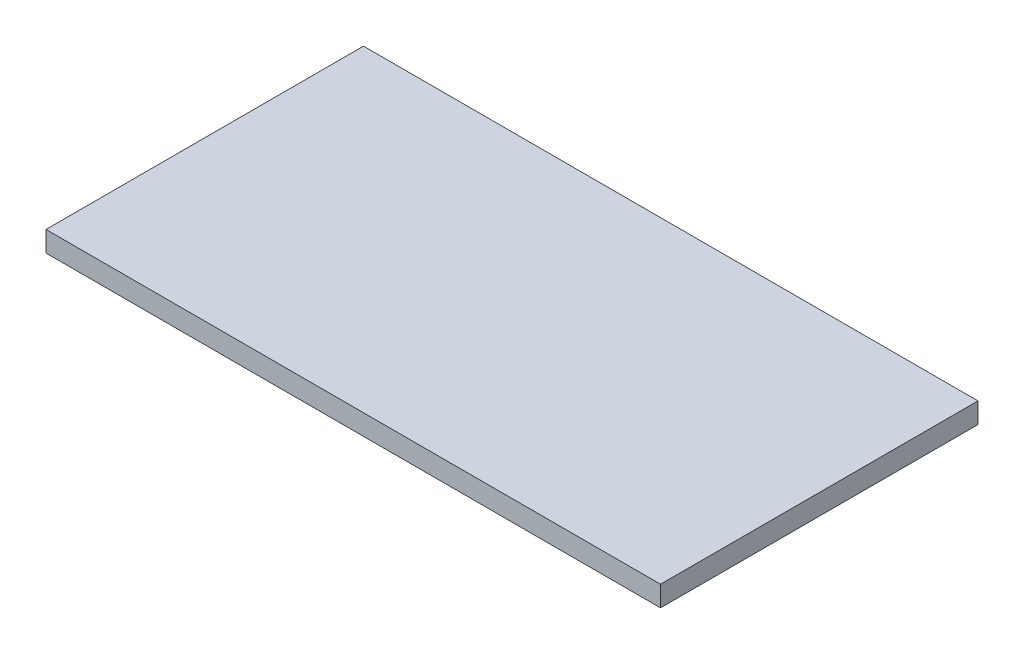
ISO-10303-21;
HEADER;
FILE_DESCRIPTION(('STEP AP214'),'2;1');
FILE_NAME('part.step','',(''),(''),'','','');
FILE_SCHEMA(('AUTOMOTIVE_DESIGN { 1 0 10303 214 1 1 1 1 }'));
ENDSEC;
DATA;
#1=APPLICATION_CONTEXT('core data for automotive mechanical design processes');
#2=APPLICATION_PROTOCOL_DEFINITION('international standard','automotive_design',2000,#1);
#3=PRODUCT_CONTEXT('',#1,'mechanical');
#4=PRODUCT('Part','Part','',(#3));
#5=PRODUCT_RELATED_PRODUCT_CATEGORY('part','',(#4));
#6=PRODUCT_DEFINITION_FORMATION('','',#4);
#7=PRODUCT_DEFINITION_CONTEXT('part definition',#1,'design');
#8=PRODUCT_DEFINITION('design','',#6,#7);
#9=PRODUCT_DEFINITION_SHAPE('','',#8);
#10=(LENGTH_UNIT() NAMED_UNIT(*) SI_UNIT(.MILLI.,.METRE.));
#11=(NAMED_UNIT(*) PLANE_ANGLE_UNIT() SI_UNIT($,.RADIAN.));
#12=(NAMED_UNIT(*) SI_UNIT($,.STERADIAN.) SOLID_ANGLE_UNIT());
#13=UNCERTAINTY_MEASURE_WITH_UNIT(LENGTH_MEASURE(1.E-05),#10,'distance_accuracy_value','');
#14=(GEOMETRIC_REPRESENTATION_CONTEXT(3) GLOBAL_UNCERTAINTY_ASSIGNED_CONTEXT((#13)) GLOBAL_UNIT_ASSIGNED_CONTEXT((#10,
#11,#12)) REPRESENTATION_CONTEXT('',''));
#15=CARTESIAN_POINT('',(0.,0.,0.));
#16=DIRECTION('',(0.,0.,1.));
#17=DIRECTION('',(1.,0.,0.));
#18=AXIS2_PLACEMENT_3D('',#15,#16,#17);
#19=CARTESIAN_POINT('',(0.,-2.,0.));
#20=DIRECTION('',(-1.,0.,0.));
#21=DIRECTION('',(0.,0.,1.));
#22=AXIS2_PLACEMENT_3D('',#19,#20,#21);
#23=PLANE('',#22);
#24=DIRECTION('',(0.,0.,1.));
#25=VECTOR('',#24,1.);
#26=CARTESIAN_POINT('',(0.,0.,0.));
#27=LINE('',#26,#25);
#28=CARTESIAN_POINT('',(0.,0.,0.));
#29=VERTEX_POINT('',#28);
#30=CARTESIAN_POINT('',(0.,0.,31.));
#31=VERTEX_POINT('',#30);
#32=EDGE_CURVE('E100',#29,#31,#27,.T.);
#33=ORIENTED_EDGE('',*,*,#32,.F.);
#34=DIRECTION('',(0.,1.,0.));
#35=VECTOR('',#34,1.);
#36=CARTESIAN_POINT('',(0.,-2.,0.));
#37=LINE('',#36,#35);
#38=CARTESIAN_POINT('',(0.,-2.,0.));
#39=VERTEX_POINT('',#38);
#40=EDGE_CURVE('E11',#39,#29,#37,.T.);
#41=ORIENTED_EDGE('',*,*,#40,.F.);
#42=DIRECTION('',(0.,0.,1.));
#43=VECTOR('',#42,1.);
#44=CARTESIAN_POINT('',(0.,-2.,0.));
#45=LINE('',#44,#43);
#46=CARTESIAN_POINT('',(0.,-2.,31.));
#47=VERTEX_POINT('',#46);
#48=EDGE_CURVE('E94',#39,#47,#45,.T.);
#49=ORIENTED_EDGE('',*,*,#48,.T.);
#50=DIRECTION('',(0.,1.,0.));
#51=VECTOR('',#50,1.);
#52=CARTESIAN_POINT('',(0.,-2.,31.));
#53=LINE('',#52,#51);
#54=EDGE_CURVE('E39',#47,#31,#53,.T.);
#55=ORIENTED_EDGE('',*,*,#54,.T.);
#56=EDGE_LOOP('',(#33,#41,#49,#55));
#57=FACE_BOUND('',#56,.T.);
#58=ADVANCED_FACE('F36',(#57),#23,.T.);
#59=CARTESIAN_POINT('',(0.,-2.,0.));
#60=DIRECTION('',(0.,0.,-1.));
#61=DIRECTION('',(-1.,0.,0.));
#62=AXIS2_PLACEMENT_3D('',#59,#60,#61);
#63=PLANE('',#62);
#64=DIRECTION('',(-1.,0.,0.));
#65=VECTOR('',#64,1.);
#66=CARTESIAN_POINT('',(0.,0.,0.));
#67=LINE('',#66,#65);
#68=CARTESIAN_POINT('',(60.,0.,0.));
#69=VERTEX_POINT('',#68);
#70=EDGE_CURVE('E96',#69,#29,#67,.T.);
#71=ORIENTED_EDGE('',*,*,#70,.F.);
#72=DIRECTION('',(0.,1.,0.));
#73=VECTOR('',#72,1.);
#74=CARTESIAN_POINT('',(60.,-2.,0.));
#75=LINE('',#74,#73);
#76=CARTESIAN_POINT('',(60.,-2.,0.));
#77=VERTEX_POINT('',#76);
#78=EDGE_CURVE('E45',#77,#69,#75,.T.);
#79=ORIENTED_EDGE('',*,*,#78,.F.);
#80=DIRECTION('',(-1.,0.,0.));
#81=VECTOR('',#80,1.);
#82=CARTESIAN_POINT('',(0.,-2.,0.));
#83=LINE('',#82,#81);
#84=EDGE_CURVE('E91',#77,#39,#83,.T.);
#85=ORIENTED_EDGE('',*,*,#84,.T.);
#86=ORIENTED_EDGE('',*,*,#40,.T.);
#87=EDGE_LOOP('',(#71,#79,#85,#86));
#88=FACE_BOUND('',#87,.T.);
#89=ADVANCED_FACE('F110',(#88),#63,.T.);
#90=CARTESIAN_POINT('',(60.,-2.,0.));
#91=DIRECTION('',(1.,0.,0.));
#92=DIRECTION('',(0.,0.,-1.));
#93=AXIS2_PLACEMENT_3D('',#90,#91,#92);
#94=PLANE('',#93);
#95=DIRECTION('',(0.,0.,-1.));
#96=VECTOR('',#95,1.);
#97=CARTESIAN_POINT('',(60.,0.,0.));
#98=LINE('',#97,#96);
#99=CARTESIAN_POINT('',(60.,0.,31.));
#100=VERTEX_POINT('',#99);
#101=EDGE_CURVE('E86',#100,#69,#98,.T.);
#102=ORIENTED_EDGE('',*,*,#101,.F.);
#103=DIRECTION('',(0.,1.,0.));
#104=VECTOR('',#103,1.);
#105=CARTESIAN_POINT('',(60.,-2.,31.));
#106=LINE('',#105,#104);
#107=CARTESIAN_POINT('',(60.,-2.,31.));
#108=VERTEX_POINT('',#107);
#109=EDGE_CURVE('E81',#108,#100,#106,.T.);
#110=ORIENTED_EDGE('',*,*,#109,.F.);
#111=DIRECTION('',(0.,0.,-1.));
#112=VECTOR('',#111,1.);
#113=CARTESIAN_POINT('',(60.,-2.,0.));
#114=LINE('',#113,#112);
#115=EDGE_CURVE('E84',#108,#77,#114,.T.);
#116=ORIENTED_EDGE('',*,*,#115,.T.);
#117=ORIENTED_EDGE('',*,*,#78,.T.);
#118=EDGE_LOOP('',(#102,#110,#116,#117));
#119=FACE_BOUND('',#118,.T.);
#120=ADVANCED_FACE('F83',(#119),#94,.T.);
#121=CARTESIAN_POINT('',(0.,-2.,31.));
#122=DIRECTION('',(0.,0.,1.));
#123=DIRECTION('',(1.,0.,0.));
#124=AXIS2_PLACEMENT_3D('',#121,#122,#123);
#125=PLANE('',#124);
#126=DIRECTION('',(1.,0.,0.));
#127=VECTOR('',#126,1.);
#128=CARTESIAN_POINT('',(0.,0.,31.));
#129=LINE('',#128,#127);
#130=EDGE_CURVE('E103',#31,#100,#129,.T.);
#131=ORIENTED_EDGE('',*,*,#130,.F.);
#132=ORIENTED_EDGE('',*,*,#54,.F.);
#133=DIRECTION('',(1.,0.,0.));
#134=VECTOR('',#133,1.);
#135=CARTESIAN_POINT('',(0.,-2.,31.));
#136=LINE('',#135,#134);
#137=EDGE_CURVE('E90',#47,#108,#136,.T.);
#138=ORIENTED_EDGE('',*,*,#137,.T.);
#139=ORIENTED_EDGE('',*,*,#109,.T.);
#140=EDGE_LOOP('',(#131,#132,#138,#139));
#141=FACE_BOUND('',#140,.T.);
#142=ADVANCED_FACE('F93',(#141),#125,.T.);
#143=CARTESIAN_POINT('',(0.,-2.,0.));
#144=DIRECTION('',(0.,1.,0.));
#145=DIRECTION('',(0.,0.,1.));
#146=AXIS2_PLACEMENT_3D('',#143,#144,#145);
#147=PLANE('',#146);
#148=ORIENTED_EDGE('',*,*,#48,.F.);
#149=ORIENTED_EDGE('',*,*,#84,.F.);
#150=ORIENTED_EDGE('',*,*,#115,.F.);
#151=ORIENTED_EDGE('',*,*,#137,.F.);
#152=EDGE_LOOP('',(#148,#149,#150,#151));
#153=FACE_BOUND('',#152,.T.);
#154=ADVANCED_FACE('F89',(#153),#147,.F.);
#155=CARTESIAN_POINT('',(0.,0.,0.));
#156=DIRECTION('',(0.,1.,0.));
#157=DIRECTION('',(0.,0.,1.));
#158=AXIS2_PLACEMENT_3D('',#155,#156,#157);
#159=PLANE('',#158);
#160=ORIENTED_EDGE('',*,*,#32,.T.);
#161=ORIENTED_EDGE('',*,*,#130,.T.);
#162=ORIENTED_EDGE('',*,*,#101,.T.);
#163=ORIENTED_EDGE('',*,*,#70,.T.);
#164=EDGE_LOOP('',(#160,#161,#162,#163));
#165=FACE_BOUND('',#164,.T.);
#166=ADVANCED_FACE('F109',(#165),#159,.T.);
#167=CLOSED_SHELL('',(#58,#89,#120,#142,#154,#166));
#168=MANIFOLD_SOLID_BREP('B2',#167);
#169=ADVANCED_BREP_SHAPE_REPRESENTATION('',(#18,#168),#14);
#170=SHAPE_DEFINITION_REPRESENTATION(#9,#169);
ENDSEC;
END-ISO-10303-21;
